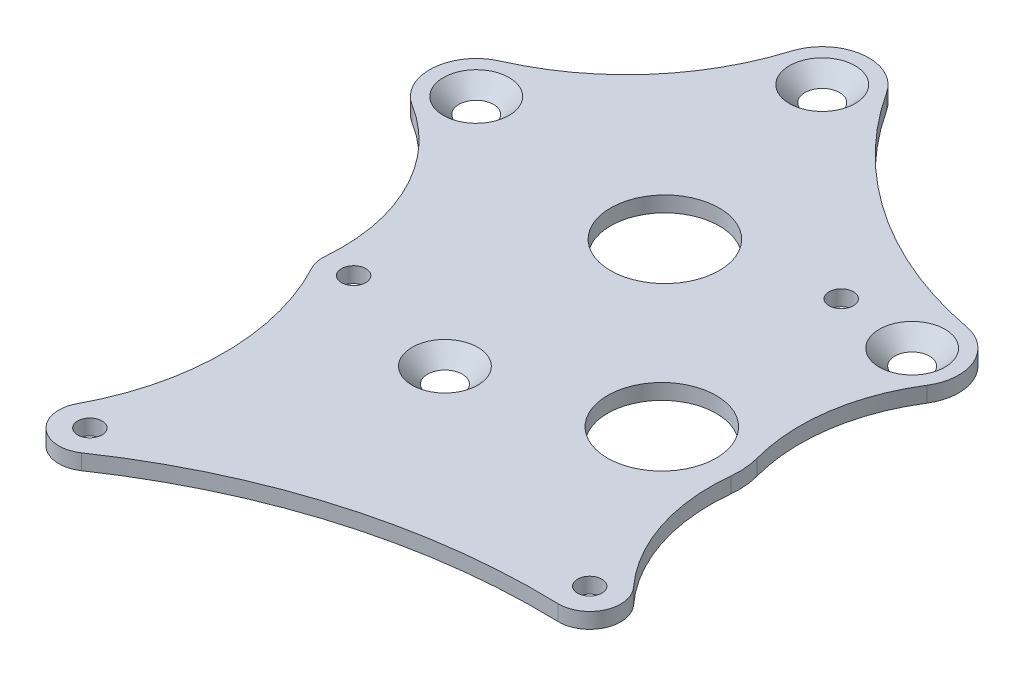
ISO-10303-21;
HEADER;
FILE_DESCRIPTION(('STEP AP214'),'2;1');
FILE_NAME('part.step','',(''),(''),'','','');
FILE_SCHEMA(('AUTOMOTIVE_DESIGN { 1 0 10303 214 1 1 1 1 }'));
ENDSEC;
DATA;
#1=APPLICATION_CONTEXT('core data for automotive mechanical design processes');
#2=APPLICATION_PROTOCOL_DEFINITION('international standard','automotive_design',2000,#1);
#3=PRODUCT_CONTEXT('',#1,'mechanical');
#4=PRODUCT('Part','Part','',(#3));
#5=PRODUCT_RELATED_PRODUCT_CATEGORY('part','',(#4));
#6=PRODUCT_DEFINITION_FORMATION('','',#4);
#7=PRODUCT_DEFINITION_CONTEXT('part definition',#1,'design');
#8=PRODUCT_DEFINITION('design','',#6,#7);
#9=PRODUCT_DEFINITION_SHAPE('','',#8);
#10=(LENGTH_UNIT() NAMED_UNIT(*) SI_UNIT(.MILLI.,.METRE.));
#11=(NAMED_UNIT(*) PLANE_ANGLE_UNIT() SI_UNIT($,.RADIAN.));
#12=(NAMED_UNIT(*) SI_UNIT($,.STERADIAN.) SOLID_ANGLE_UNIT());
#13=UNCERTAINTY_MEASURE_WITH_UNIT(LENGTH_MEASURE(1.E-05),#10,'distance_accuracy_value','');
#14=(GEOMETRIC_REPRESENTATION_CONTEXT(3) GLOBAL_UNCERTAINTY_ASSIGNED_CONTEXT((#13)) GLOBAL_UNIT_ASSIGNED_CONTEXT((#10,
#11,#12)) REPRESENTATION_CONTEXT('',''));
#15=CARTESIAN_POINT('',(0.,0.,0.));
#16=DIRECTION('',(0.,0.,1.));
#17=DIRECTION('',(1.,0.,0.));
#18=AXIS2_PLACEMENT_3D('',#15,#16,#17);
#19=CARTESIAN_POINT('',(40.1473132785361,11.4299999999996,-115.016732099234));
#20=DIRECTION('',(0.,1.,0.));
#21=DIRECTION('',(0.,0.,1.));
#22=AXIS2_PLACEMENT_3D('',#19,#20,#21);
#23=PLANE('',#22);
#24=CARTESIAN_POINT('',(-57.2999999999999,11.4299999999995,-136.359646841813));
#25=DIRECTION('',(0.,1.,0.));
#26=DIRECTION('',(0.,0.,1.));
#27=AXIS2_PLACEMENT_3D('',#24,#25,#26);
#28=CIRCLE('',#27,3.545);
#29=CARTESIAN_POINT('',(-57.2999999999999,11.4299999999995,-132.814646841813));
#30=VERTEX_POINT('',#29);
#31=EDGE_CURVE('E568',#30,#30,#28,.T.);
#32=ORIENTED_EDGE('',*,*,#31,.T.);
#33=EDGE_LOOP('',(#32));
#34=FACE_BOUND('',#33,.T.);
#35=CARTESIAN_POINT('',(-23.9999999999999,11.4299999999994,-173.859646841813));
#36=DIRECTION('',(0.,1.,0.));
#37=DIRECTION('',(0.,0.,1.));
#38=AXIS2_PLACEMENT_3D('',#35,#36,#37);
#39=CIRCLE('',#38,3.545);
#40=CARTESIAN_POINT('',(-23.9999999999999,11.4299999999994,-170.314646841813));
#41=VERTEX_POINT('',#40);
#42=EDGE_CURVE('E37',#41,#41,#39,.T.);
#43=ORIENTED_EDGE('',*,*,#42,.T.);
#44=EDGE_LOOP('',(#43));
#45=FACE_BOUND('',#44,.T.);
#46=CARTESIAN_POINT('',(31.9000000000001,11.4299999999995,-136.359646841813));
#47=DIRECTION('',(0.,1.,0.));
#48=DIRECTION('',(0.,0.,1.));
#49=AXIS2_PLACEMENT_3D('',#46,#47,#48);
#50=CIRCLE('',#49,3.54499999999999);
#51=CARTESIAN_POINT('',(31.9000000000001,11.4299999999995,-132.814646841813));
#52=VERTEX_POINT('',#51);
#53=EDGE_CURVE('E269',#52,#52,#50,.T.);
#54=ORIENTED_EDGE('',*,*,#53,.T.);
#55=EDGE_LOOP('',(#54));
#56=FACE_BOUND('',#55,.T.);
#57=CARTESIAN_POINT('',(-12.6999999999999,11.4299999999997,-85.3596468418129));
#58=DIRECTION('',(0.,1.,0.));
#59=DIRECTION('',(0.,0.,1.));
#60=AXIS2_PLACEMENT_3D('',#57,#58,#59);
#61=CIRCLE('',#60,3.545);
#62=CARTESIAN_POINT('',(-12.6999999999999,11.4299999999997,-81.8146468418129));
#63=VERTEX_POINT('',#62);
#64=EDGE_CURVE('E165',#63,#63,#61,.T.);
#65=ORIENTED_EDGE('',*,*,#64,.T.);
#66=EDGE_LOOP('',(#65));
#67=FACE_BOUND('',#66,.T.);
#68=CARTESIAN_POINT('',(-38.0999999999997,11.4299999999997,-92.0750000000001));
#69=DIRECTION('',(0.,1.,0.));
#70=DIRECTION('',(0.,0.,1.));
#71=AXIS2_PLACEMENT_3D('',#68,#69,#70);
#72=CIRCLE('',#71,6.35000000000001);
#73=CARTESIAN_POINT('',(-44.4267190902274,11.4299999999997,-92.6182545934906));
#74=VERTEX_POINT('',#73);
#75=CARTESIAN_POINT('',(-43.6973950552304,11.4299999999997,-89.076388888889));
#76=VERTEX_POINT('',#75);
#77=EDGE_CURVE('E225',#74,#76,#72,.T.);
#78=ORIENTED_EDGE('',*,*,#77,.F.);
#79=CARTESIAN_POINT('',(-82.3870336315935,11.4299999999997,-95.8777821544335));
#80=DIRECTION('',(0.,1.,0.));
#81=DIRECTION('',(0.,0.,1.));
#82=AXIS2_PLACEMENT_3D('',#79,#80,#81);
#83=CIRCLE('',#82,38.1);
#84=CARTESIAN_POINT('',(-62.3174067263185,11.4299999999996,-128.263273904337));
#85=VERTEX_POINT('',#84);
#86=EDGE_CURVE('E197',#74,#85,#83,.T.);
#87=ORIENTED_EDGE('',*,*,#86,.T.);
#88=CARTESIAN_POINT('',(-57.2999999999999,11.4299999999995,-136.359646841813));
#89=DIRECTION('',(0.,1.,0.));
#90=DIRECTION('',(0.,0.,1.));
#91=AXIS2_PLACEMENT_3D('',#88,#89,#90);
#92=CIRCLE('',#91,9.525);
#93=CARTESIAN_POINT('',(-61.1488031312675,11.4299999999995,-145.072415601326));
#94=VERTEX_POINT('',#93);
#95=EDGE_CURVE('E294',#85,#94,#92,.F.);
#96=ORIENTED_EDGE('',*,*,#95,.T.);
#97=CARTESIAN_POINT('',(-81.6757531646944,11.4299999999993,-191.540515652062));
#98=DIRECTION('',(0.,1.,0.));
#99=DIRECTION('',(0.,0.,1.));
#100=AXIS2_PLACEMENT_3D('',#97,#98,#99);
#101=CIRCLE('',#100,50.8);
#102=CARTESIAN_POINT('',(-33.1066978681096,11.4299999999994,-176.651362969747));
#103=VERTEX_POINT('',#102);
#104=EDGE_CURVE('E292',#94,#103,#101,.T.);
#105=ORIENTED_EDGE('',*,*,#104,.T.);
#106=CARTESIAN_POINT('',(-23.9999999999999,11.4299999999994,-173.859646841813));
#107=DIRECTION('',(0.,1.,0.));
#108=DIRECTION('',(0.,0.,1.));
#109=AXIS2_PLACEMENT_3D('',#106,#107,#108);
#110=CIRCLE('',#109,9.525);
#111=CARTESIAN_POINT('',(-16.0141646020796,11.4299999999994,-179.051183993498));
#112=VERTEX_POINT('',#111);
#113=EDGE_CURVE('E290',#103,#112,#110,.F.);
#114=ORIENTED_EDGE('',*,*,#113,.T.);
#115=CARTESIAN_POINT('',(47.872518581282,11.4299999999992,-220.583481206977));
#116=DIRECTION('',(0.,1.,0.));
#117=DIRECTION('',(0.,0.,1.));
#118=AXIS2_PLACEMENT_3D('',#115,#116,#117);
#119=CIRCLE('',#118,76.2);
#120=CARTESIAN_POINT('',(33.6747242868093,11.4299999999995,-145.717850660164));
#121=VERTEX_POINT('',#120);
#122=EDGE_CURVE('E288',#112,#121,#119,.T.);
#123=ORIENTED_EDGE('',*,*,#122,.T.);
#124=CARTESIAN_POINT('',(31.9000000000001,11.4299999999995,-136.359646841813));
#125=DIRECTION('',(0.,1.,0.));
#126=DIRECTION('',(0.,0.,1.));
#127=AXIS2_PLACEMENT_3D('',#124,#125,#126);
#128=CIRCLE('',#127,9.52499999999998);
#129=CARTESIAN_POINT('',(39.973858004257,11.4299999999995,-131.306089488117));
#130=VERTEX_POINT('',#129);
#131=EDGE_CURVE('E286',#121,#130,#128,.F.);
#132=ORIENTED_EDGE('',*,*,#131,.T.);
#133=CARTESIAN_POINT('',(72.269290021285,11.4299999999996,-111.091860073333));
#134=DIRECTION('',(0.,1.,0.));
#135=DIRECTION('',(0.,0.,1.));
#136=AXIS2_PLACEMENT_3D('',#133,#134,#135);
#137=CIRCLE('',#136,38.1);
#138=CARTESIAN_POINT('',(35.5247124459098,11.4299999999996,-101.019818631438));
#139=VERTEX_POINT('',#138);
#140=EDGE_CURVE('E142',#130,#139,#137,.T.);
#141=ORIENTED_EDGE('',*,*,#140,.T.);
#142=CARTESIAN_POINT('',(20.2144717895034,11.4299999999997,-96.823134697316));
#143=DIRECTION('',(0.,1.,0.));
#144=DIRECTION('',(0.,0.,1.));
#145=AXIS2_PLACEMENT_3D('',#142,#143,#144);
#146=CIRCLE('',#145,15.875);
#147=CARTESIAN_POINT('',(36.0026550587363,11.4299999999997,-95.1651557899969));
#148=VERTEX_POINT('',#147);
#149=EDGE_CURVE('E230',#148,#139,#146,.T.);
#150=ORIENTED_EDGE('',*,*,#149,.F.);
#151=CARTESIAN_POINT('',(73.8942949048952,11.4299999999997,-91.1860064124311));
#152=DIRECTION('',(0.,-1.,0.));
#153=DIRECTION('',(0.,0.,1.));
#154=AXIS2_PLACEMENT_3D('',#151,#152,#153);
#155=CIRCLE('',#154,38.1);
#156=CARTESIAN_POINT('',(45.7635261068066,11.4299999999998,-65.4902899050347));
#157=VERTEX_POINT('',#156);
#158=EDGE_CURVE('E251',#157,#148,#155,.T.);
#159=ORIENTED_EDGE('',*,*,#158,.F.);
#160=CARTESIAN_POINT('',(41.0750646404585,11.4299999999998,-61.2076704871353));
#161=DIRECTION('',(0.,1.,0.));
#162=DIRECTION('',(0.,0.,1.));
#163=AXIS2_PLACEMENT_3D('',#160,#161,#162);
#164=CIRCLE('',#163,6.35000000000001);
#165=CARTESIAN_POINT('',(40.8817934804246,11.4299999999998,-54.8606124080959));
#166=VERTEX_POINT('',#165);
#167=EDGE_CURVE('E249',#166,#157,#164,.T.);
#168=ORIENTED_EDGE('',*,*,#167,.F.);
#169=CARTESIAN_POINT('',(37.0163702797469,11.4300000000003,72.0805491726918));
#170=DIRECTION('',(0.,-1.,0.));
#171=DIRECTION('',(0.,0.,-1.));
#172=AXIS2_PLACEMENT_3D('',#169,#170,#171);
#173=CIRCLE('',#172,127.);
#174=CARTESIAN_POINT('',(-34.5230299866786,11.4299999999999,-32.8533071822529));
#175=VERTEX_POINT('',#174);
#176=EDGE_CURVE('E247',#175,#166,#173,.T.);
#177=ORIENTED_EDGE('',*,*,#176,.F.);
#178=CARTESIAN_POINT('',(-38.0999999999999,11.4299999999999,-38.1000000000001));
#179=DIRECTION('',(0.,1.,0.));
#180=DIRECTION('',(0.,0.,1.));
#181=AXIS2_PLACEMENT_3D('',#178,#179,#180);
#182=CIRCLE('',#181,6.35000000000001);
#183=CARTESIAN_POINT('',(-43.6973950552306,11.4299999999999,-41.0986111111112));
#184=VERTEX_POINT('',#183);
#185=EDGE_CURVE('E245',#184,#175,#182,.T.);
#186=ORIENTED_EDGE('',*,*,#185,.F.);
#187=CARTESIAN_POINT('',(-88.476555497076,11.4299999999998,-65.0875000000003));
#188=DIRECTION('',(0.,-1.,0.));
#189=DIRECTION('',(0.,0.,-1.));
#190=AXIS2_PLACEMENT_3D('',#187,#188,#189);
#191=CIRCLE('',#190,50.8);
#192=EDGE_CURVE('E243',#76,#184,#191,.T.);
#193=ORIENTED_EDGE('',*,*,#192,.F.);
#194=EDGE_LOOP('',(#78,#87,#96,#105,#114,#123,#132,#141,#150,#159,#168,#177,#186,#193));
#195=FACE_BOUND('',#194,.T.);
#196=CARTESIAN_POINT('',(-38.0999999999997,11.4299999999997,-92.0750000000001));
#197=DIRECTION('',(0.,1.,0.));
#198=DIRECTION('',(0.,0.,1.));
#199=AXIS2_PLACEMENT_3D('',#196,#197,#198);
#200=CIRCLE('',#199,2.4892);
#201=CARTESIAN_POINT('',(-38.0999999999997,11.4299999999997,-89.5858000000001));
#202=VERTEX_POINT('',#201);
#203=EDGE_CURVE('E219',#202,#202,#200,.T.);
#204=ORIENTED_EDGE('',*,*,#203,.T.);
#205=EDGE_LOOP('',(#204));
#206=FACE_BOUND('',#205,.T.);
#207=CARTESIAN_POINT('',(-38.0999999999999,11.4299999999999,-38.1000000000001));
#208=DIRECTION('',(0.,1.,0.));
#209=DIRECTION('',(0.,0.,1.));
#210=AXIS2_PLACEMENT_3D('',#207,#208,#209);
#211=CIRCLE('',#210,2.4892);
#212=CARTESIAN_POINT('',(-38.0999999999999,11.4299999999999,-35.6108000000001));
#213=VERTEX_POINT('',#212);
#214=EDGE_CURVE('E213',#213,#213,#211,.T.);
#215=ORIENTED_EDGE('',*,*,#214,.T.);
#216=EDGE_LOOP('',(#215));
#217=FACE_BOUND('',#216,.T.);
#218=CARTESIAN_POINT('',(15.8750000000005,11.4299999999995,-137.869384338277));
#219=DIRECTION('',(0.,1.,0.));
#220=DIRECTION('',(0.,0.,1.));
#221=AXIS2_PLACEMENT_3D('',#218,#219,#220);
#222=CIRCLE('',#221,2.4892);
#223=CARTESIAN_POINT('',(15.8750000000005,11.4299999999995,-135.380184338277));
#224=VERTEX_POINT('',#223);
#225=EDGE_CURVE('E207',#224,#224,#222,.T.);
#226=ORIENTED_EDGE('',*,*,#225,.T.);
#227=EDGE_LOOP('',(#226));
#228=FACE_BOUND('',#227,.T.);
#229=CARTESIAN_POINT('',(41.0750646404585,11.4299999999998,-61.2076704871353));
#230=DIRECTION('',(0.,1.,0.));
#231=DIRECTION('',(0.,0.,1.));
#232=AXIS2_PLACEMENT_3D('',#229,#230,#231);
#233=CIRCLE('',#232,2.4892);
#234=CARTESIAN_POINT('',(41.0750646404585,11.4299999999998,-58.7184704871353));
#235=VERTEX_POINT('',#234);
#236=EDGE_CURVE('E201',#235,#235,#233,.T.);
#237=ORIENTED_EDGE('',*,*,#236,.T.);
#238=EDGE_LOOP('',(#237));
#239=FACE_BOUND('',#238,.T.);
#240=CARTESIAN_POINT('',(20.2144717895034,11.4299999999997,-96.823134697316));
#241=DIRECTION('',(0.,1.,0.));
#242=DIRECTION('',(0.,0.,1.));
#243=AXIS2_PLACEMENT_3D('',#240,#241,#242);
#244=CIRCLE('',#243,11.1125);
#245=CARTESIAN_POINT('',(20.2144717895034,11.4299999999997,-85.710634697316));
#246=VERTEX_POINT('',#245);
#247=EDGE_CURVE('E193',#246,#246,#244,.T.);
#248=ORIENTED_EDGE('',*,*,#247,.T.);
#249=EDGE_LOOP('',(#248));
#250=FACE_BOUND('',#249,.T.);
#251=CARTESIAN_POINT('',(-12.6999999999999,11.4299999999995,-130.359646841813));
#252=DIRECTION('',(0.,1.,0.));
#253=DIRECTION('',(0.,0.,1.));
#254=AXIS2_PLACEMENT_3D('',#251,#252,#253);
#255=CIRCLE('',#254,11.1125);
#256=CARTESIAN_POINT('',(-12.6999999999999,11.4299999999996,-119.247146841813));
#257=VERTEX_POINT('',#256);
#258=EDGE_CURVE('E194',#257,#257,#255,.T.);
#259=ORIENTED_EDGE('',*,*,#258,.T.);
#260=EDGE_LOOP('',(#259));
#261=FACE_BOUND('',#260,.T.);
#262=ADVANCED_FACE('F33',(#34,#45,#56,#67,#195,#206,#217,#228,#239,#250,#261),#23,.F.);
#263=CARTESIAN_POINT('',(-38.0999999999997,14.6049999999997,-92.0750000000001));
#264=DIRECTION('',(0.,-1.,0.));
#265=DIRECTION('',(0.,0.,-1.));
#266=AXIS2_PLACEMENT_3D('',#263,#264,#265);
#267=CYLINDRICAL_SURFACE('',#266,6.35000000000001);
#268=DIRECTION('',(0.,1.,0.));
#269=VECTOR('',#268,1.);
#270=CARTESIAN_POINT('',(-44.4267190902274,-129.837832367374,-92.6182545934901));
#271=LINE('',#270,#269);
#272=CARTESIAN_POINT('',(-44.4267190902274,14.6049999999997,-92.6182545934906));
#273=VERTEX_POINT('',#272);
#274=EDGE_CURVE('E54',#74,#273,#271,.T.);
#275=ORIENTED_EDGE('',*,*,#274,.F.);
#276=ORIENTED_EDGE('',*,*,#77,.T.);
#277=DIRECTION('',(0.,-1.,0.));
#278=VECTOR('',#277,1.);
#279=CARTESIAN_POINT('',(-43.6973950552304,14.6049999999997,-89.076388888889));
#280=LINE('',#279,#278);
#281=CARTESIAN_POINT('',(-43.6973950552304,14.6049999999997,-89.076388888889));
#282=VERTEX_POINT('',#281);
#283=EDGE_CURVE('E11',#282,#76,#280,.T.);
#284=ORIENTED_EDGE('',*,*,#283,.F.);
#285=CARTESIAN_POINT('',(-38.0999999999997,14.6049999999997,-92.0750000000001));
#286=DIRECTION('',(0.,1.,0.));
#287=DIRECTION('',(0.,0.,1.));
#288=AXIS2_PLACEMENT_3D('',#285,#286,#287);
#289=CIRCLE('',#288,6.35000000000001);
#290=EDGE_CURVE('E50',#273,#282,#289,.T.);
#291=ORIENTED_EDGE('',*,*,#290,.F.);
#292=EDGE_LOOP('',(#275,#276,#284,#291));
#293=FACE_BOUND('',#292,.T.);
#294=ADVANCED_FACE('F35',(#293),#267,.T.);
#295=CARTESIAN_POINT('',(40.1473132785361,14.6049999999996,-115.016732099235));
#296=DIRECTION('',(0.,1.,0.));
#297=DIRECTION('',(0.,0.,1.));
#298=AXIS2_PLACEMENT_3D('',#295,#296,#297);
#299=PLANE('',#298);
#300=CARTESIAN_POINT('',(-57.2999999999999,14.6049999999995,-136.359646841813));
#301=DIRECTION('',(0.,1.,0.));
#302=DIRECTION('',(0.,0.,1.));
#303=AXIS2_PLACEMENT_3D('',#300,#301,#302);
#304=CIRCLE('',#303,6.72);
#305=CARTESIAN_POINT('',(-57.2999999999999,14.6049999999995,-129.639646841813));
#306=VERTEX_POINT('',#305);
#307=EDGE_CURVE('E566',#306,#306,#304,.T.);
#308=ORIENTED_EDGE('',*,*,#307,.F.);
#309=EDGE_LOOP('',(#308));
#310=FACE_BOUND('',#309,.T.);
#311=CARTESIAN_POINT('',(-23.9999999999999,14.6049999999994,-173.859646841813));
#312=DIRECTION('',(0.,1.,0.));
#313=DIRECTION('',(0.,0.,1.));
#314=AXIS2_PLACEMENT_3D('',#311,#312,#313);
#315=CIRCLE('',#314,6.72);
#316=CARTESIAN_POINT('',(-23.9999999999999,14.6049999999994,-167.139646841813));
#317=VERTEX_POINT('',#316);
#318=EDGE_CURVE('E281',#317,#317,#315,.T.);
#319=ORIENTED_EDGE('',*,*,#318,.F.);
#320=EDGE_LOOP('',(#319));
#321=FACE_BOUND('',#320,.T.);
#322=CARTESIAN_POINT('',(31.9000000000001,14.6049999999995,-136.359646841813));
#323=DIRECTION('',(0.,1.,0.));
#324=DIRECTION('',(0.,0.,1.));
#325=AXIS2_PLACEMENT_3D('',#322,#323,#324);
#326=CIRCLE('',#325,6.72);
#327=CARTESIAN_POINT('',(31.9000000000001,14.6049999999995,-129.639646841813));
#328=VERTEX_POINT('',#327);
#329=EDGE_CURVE('E271',#328,#328,#326,.T.);
#330=ORIENTED_EDGE('',*,*,#329,.F.);
#331=EDGE_LOOP('',(#330));
#332=FACE_BOUND('',#331,.T.);
#333=CARTESIAN_POINT('',(-12.6999999999999,14.6049999999997,-85.3596468418129));
#334=DIRECTION('',(0.,1.,0.));
#335=DIRECTION('',(0.,0.,1.));
#336=AXIS2_PLACEMENT_3D('',#333,#334,#335);
#337=CIRCLE('',#336,6.72);
#338=CARTESIAN_POINT('',(-12.6999999999999,14.6049999999997,-78.6396468418129));
#339=VERTEX_POINT('',#338);
#340=EDGE_CURVE('E268',#339,#339,#337,.T.);
#341=ORIENTED_EDGE('',*,*,#340,.F.);
#342=EDGE_LOOP('',(#341));
#343=FACE_BOUND('',#342,.T.);
#344=CARTESIAN_POINT('',(-82.3870336315935,14.6049999999997,-95.8777821544335));
#345=DIRECTION('',(0.,-1.,0.));
#346=DIRECTION('',(0.,0.,-1.));
#347=AXIS2_PLACEMENT_3D('',#344,#345,#346);
#348=CIRCLE('',#347,38.1);
#349=CARTESIAN_POINT('',(-62.3174067263186,14.6049999999996,-128.263273904337));
#350=VERTEX_POINT('',#349);
#351=EDGE_CURVE('E163',#350,#273,#348,.T.);
#352=ORIENTED_EDGE('',*,*,#351,.T.);
#353=ORIENTED_EDGE('',*,*,#290,.T.);
#354=CARTESIAN_POINT('',(-88.476555497076,14.6049999999998,-65.0875000000003));
#355=DIRECTION('',(0.,-1.,0.));
#356=DIRECTION('',(0.,0.,-1.));
#357=AXIS2_PLACEMENT_3D('',#354,#355,#356);
#358=CIRCLE('',#357,50.8);
#359=CARTESIAN_POINT('',(-43.6973950552306,14.6049999999999,-41.0986111111113));
#360=VERTEX_POINT('',#359);
#361=EDGE_CURVE('E229',#282,#360,#358,.T.);
#362=ORIENTED_EDGE('',*,*,#361,.T.);
#363=CARTESIAN_POINT('',(-38.0999999999999,14.6049999999999,-38.1000000000001));
#364=DIRECTION('',(0.,1.,0.));
#365=DIRECTION('',(0.,0.,1.));
#366=AXIS2_PLACEMENT_3D('',#363,#364,#365);
#367=CIRCLE('',#366,6.35000000000001);
#368=CARTESIAN_POINT('',(-34.5230299866786,14.6049999999999,-32.8533071822529));
#369=VERTEX_POINT('',#368);
#370=EDGE_CURVE('E232',#360,#369,#367,.T.);
#371=ORIENTED_EDGE('',*,*,#370,.T.);
#372=CARTESIAN_POINT('',(37.0163702797469,14.6050000000002,72.0805491726918));
#373=DIRECTION('',(0.,-1.,0.));
#374=DIRECTION('',(0.,0.,-1.));
#375=AXIS2_PLACEMENT_3D('',#372,#373,#374);
#376=CIRCLE('',#375,127.);
#377=CARTESIAN_POINT('',(40.8817934804246,14.6049999999998,-54.8606124080959));
#378=VERTEX_POINT('',#377);
#379=EDGE_CURVE('E234',#369,#378,#376,.T.);
#380=ORIENTED_EDGE('',*,*,#379,.T.);
#381=CARTESIAN_POINT('',(41.0750646404585,14.6049999999998,-61.2076704871353));
#382=DIRECTION('',(0.,1.,0.));
#383=DIRECTION('',(0.,0.,1.));
#384=AXIS2_PLACEMENT_3D('',#381,#382,#383);
#385=CIRCLE('',#384,6.35000000000001);
#386=CARTESIAN_POINT('',(45.7635261068066,14.6049999999998,-65.4902899050347));
#387=VERTEX_POINT('',#386);
#388=EDGE_CURVE('E236',#378,#387,#385,.T.);
#389=ORIENTED_EDGE('',*,*,#388,.T.);
#390=CARTESIAN_POINT('',(73.8942949048952,14.6049999999997,-91.1860064124312));
#391=DIRECTION('',(0.,-1.,0.));
#392=DIRECTION('',(0.,0.,1.));
#393=AXIS2_PLACEMENT_3D('',#390,#391,#392);
#394=CIRCLE('',#393,38.1);
#395=CARTESIAN_POINT('',(36.0026550587363,14.6049999999997,-95.1651557899969));
#396=VERTEX_POINT('',#395);
#397=EDGE_CURVE('E238',#387,#396,#394,.T.);
#398=ORIENTED_EDGE('',*,*,#397,.T.);
#399=CARTESIAN_POINT('',(20.2144717895034,14.6049999999997,-96.823134697316));
#400=DIRECTION('',(0.,1.,0.));
#401=DIRECTION('',(0.,0.,1.));
#402=AXIS2_PLACEMENT_3D('',#399,#400,#401);
#403=CIRCLE('',#402,15.875);
#404=CARTESIAN_POINT('',(35.5247124459098,14.6049999999996,-101.019818631439));
#405=VERTEX_POINT('',#404);
#406=EDGE_CURVE('E162',#396,#405,#403,.T.);
#407=ORIENTED_EDGE('',*,*,#406,.T.);
#408=CARTESIAN_POINT('',(72.269290021285,14.6049999999996,-111.091860073333));
#409=DIRECTION('',(0.,-1.,0.));
#410=DIRECTION('',(0.,0.,1.));
#411=AXIS2_PLACEMENT_3D('',#408,#409,#410);
#412=CIRCLE('',#411,38.1);
#413=CARTESIAN_POINT('',(39.9738580042571,14.6049999999995,-131.306089488117));
#414=VERTEX_POINT('',#413);
#415=EDGE_CURVE('E140',#405,#414,#412,.T.);
#416=ORIENTED_EDGE('',*,*,#415,.T.);
#417=CARTESIAN_POINT('',(31.9000000000001,14.6049999999995,-136.359646841813));
#418=DIRECTION('',(0.,1.,0.));
#419=DIRECTION('',(0.,0.,1.));
#420=AXIS2_PLACEMENT_3D('',#417,#418,#419);
#421=CIRCLE('',#420,9.52499999999998);
#422=CARTESIAN_POINT('',(33.6747242868092,14.6049999999995,-145.717850660165));
#423=VERTEX_POINT('',#422);
#424=EDGE_CURVE('E149',#414,#423,#421,.T.);
#425=ORIENTED_EDGE('',*,*,#424,.T.);
#426=CARTESIAN_POINT('',(47.872518581282,14.6049999999992,-220.583481206977));
#427=DIRECTION('',(0.,-1.,0.));
#428=DIRECTION('',(0.,0.,1.));
#429=AXIS2_PLACEMENT_3D('',#426,#427,#428);
#430=CIRCLE('',#429,76.2);
#431=CARTESIAN_POINT('',(-16.0141646020797,14.6049999999994,-179.051183993498));
#432=VERTEX_POINT('',#431);
#433=EDGE_CURVE('E155',#423,#432,#430,.T.);
#434=ORIENTED_EDGE('',*,*,#433,.T.);
#435=CARTESIAN_POINT('',(-23.9999999999999,14.6049999999994,-173.859646841813));
#436=DIRECTION('',(0.,1.,0.));
#437=DIRECTION('',(0.,0.,1.));
#438=AXIS2_PLACEMENT_3D('',#435,#436,#437);
#439=CIRCLE('',#438,9.525);
#440=CARTESIAN_POINT('',(-33.1066978681096,14.6049999999994,-176.651362969747));
#441=VERTEX_POINT('',#440);
#442=EDGE_CURVE('E170',#432,#441,#439,.T.);
#443=ORIENTED_EDGE('',*,*,#442,.T.);
#444=CARTESIAN_POINT('',(-81.6757531646944,14.6049999999993,-191.540515652062));
#445=DIRECTION('',(0.,-1.,0.));
#446=DIRECTION('',(0.,0.,1.));
#447=AXIS2_PLACEMENT_3D('',#444,#445,#446);
#448=CIRCLE('',#447,50.8);
#449=CARTESIAN_POINT('',(-61.1488031312674,14.6049999999995,-145.072415601326));
#450=VERTEX_POINT('',#449);
#451=EDGE_CURVE('E173',#441,#450,#448,.T.);
#452=ORIENTED_EDGE('',*,*,#451,.T.);
#453=CARTESIAN_POINT('',(-57.2999999999999,14.6049999999995,-136.359646841813));
#454=DIRECTION('',(0.,1.,0.));
#455=DIRECTION('',(0.,0.,1.));
#456=AXIS2_PLACEMENT_3D('',#453,#454,#455);
#457=CIRCLE('',#456,9.525);
#458=EDGE_CURVE('E176',#450,#350,#457,.T.);
#459=ORIENTED_EDGE('',*,*,#458,.T.);
#460=EDGE_LOOP('',(#352,#353,#362,#371,#380,#389,#398,#407,#416,#425,#434,#443,#452,#459));
#461=FACE_BOUND('',#460,.T.);
#462=CARTESIAN_POINT('',(20.2144717895034,14.6049999999997,-96.823134697316));
#463=DIRECTION('',(0.,1.,0.));
#464=DIRECTION('',(0.,0.,1.));
#465=AXIS2_PLACEMENT_3D('',#462,#463,#464);
#466=CIRCLE('',#465,11.1125);
#467=CARTESIAN_POINT('',(20.2144717895034,14.6049999999997,-85.710634697316));
#468=VERTEX_POINT('',#467);
#469=EDGE_CURVE('E198',#468,#468,#466,.T.);
#470=ORIENTED_EDGE('',*,*,#469,.F.);
#471=EDGE_LOOP('',(#470));
#472=FACE_BOUND('',#471,.T.);
#473=CARTESIAN_POINT('',(15.8750000000005,14.6049999999995,-137.869384338277));
#474=DIRECTION('',(0.,1.,0.));
#475=DIRECTION('',(0.,0.,1.));
#476=AXIS2_PLACEMENT_3D('',#473,#474,#475);
#477=CIRCLE('',#476,2.4892);
#478=CARTESIAN_POINT('',(15.8750000000005,14.6049999999995,-135.380184338277));
#479=VERTEX_POINT('',#478);
#480=EDGE_CURVE('E210',#479,#479,#477,.T.);
#481=ORIENTED_EDGE('',*,*,#480,.F.);
#482=EDGE_LOOP('',(#481));
#483=FACE_BOUND('',#482,.T.);
#484=CARTESIAN_POINT('',(-38.0999999999997,14.6049999999997,-92.0750000000001));
#485=DIRECTION('',(0.,1.,0.));
#486=DIRECTION('',(0.,0.,1.));
#487=AXIS2_PLACEMENT_3D('',#484,#485,#486);
#488=CIRCLE('',#487,2.4892);
#489=CARTESIAN_POINT('',(-38.0999999999997,14.6049999999997,-89.5858000000001));
#490=VERTEX_POINT('',#489);
#491=EDGE_CURVE('E222',#490,#490,#488,.T.);
#492=ORIENTED_EDGE('',*,*,#491,.F.);
#493=EDGE_LOOP('',(#492));
#494=FACE_BOUND('',#493,.T.);
#495=CARTESIAN_POINT('',(-38.0999999999999,14.6049999999999,-38.1000000000001));
#496=DIRECTION('',(0.,1.,0.));
#497=DIRECTION('',(0.,0.,1.));
#498=AXIS2_PLACEMENT_3D('',#495,#496,#497);
#499=CIRCLE('',#498,2.4892);
#500=CARTESIAN_POINT('',(-38.0999999999999,14.6049999999999,-35.6108000000001));
#501=VERTEX_POINT('',#500);
#502=EDGE_CURVE('E216',#501,#501,#499,.T.);
#503=ORIENTED_EDGE('',*,*,#502,.F.);
#504=EDGE_LOOP('',(#503));
#505=FACE_BOUND('',#504,.T.);
#506=CARTESIAN_POINT('',(41.0750646404585,14.6049999999998,-61.2076704871353));
#507=DIRECTION('',(0.,1.,0.));
#508=DIRECTION('',(0.,0.,1.));
#509=AXIS2_PLACEMENT_3D('',#506,#507,#508);
#510=CIRCLE('',#509,2.4892);
#511=CARTESIAN_POINT('',(41.0750646404585,14.6049999999998,-58.7184704871353));
#512=VERTEX_POINT('',#511);
#513=EDGE_CURVE('E204',#512,#512,#510,.T.);
#514=ORIENTED_EDGE('',*,*,#513,.F.);
#515=EDGE_LOOP('',(#514));
#516=FACE_BOUND('',#515,.T.);
#517=CARTESIAN_POINT('',(-12.6999999999999,14.6049999999995,-130.359646841813));
#518=DIRECTION('',(0.,1.,0.));
#519=DIRECTION('',(0.,0.,1.));
#520=AXIS2_PLACEMENT_3D('',#517,#518,#519);
#521=CIRCLE('',#520,11.1125);
#522=CARTESIAN_POINT('',(-12.6999999999999,14.6049999999996,-119.247146841813));
#523=VERTEX_POINT('',#522);
#524=EDGE_CURVE('E190',#523,#523,#521,.T.);
#525=ORIENTED_EDGE('',*,*,#524,.F.);
#526=EDGE_LOOP('',(#525));
#527=FACE_BOUND('',#526,.T.);
#528=ADVANCED_FACE('F159',(#310,#321,#332,#343,#461,#472,#483,#494,#505,#516,#527),#299,.T.);
#529=CARTESIAN_POINT('',(-88.476555497076,14.6049999999998,-65.0875000000003));
#530=DIRECTION('',(0.,-1.,0.));
#531=DIRECTION('',(0.,0.,-1.));
#532=AXIS2_PLACEMENT_3D('',#529,#530,#531);
#533=CYLINDRICAL_SURFACE('',#532,50.8);
#534=ORIENTED_EDGE('',*,*,#192,.T.);
#535=DIRECTION('',(0.,-1.,0.));
#536=VECTOR('',#535,1.);
#537=CARTESIAN_POINT('',(-43.6973950552306,14.6049999999999,-41.0986111111113));
#538=LINE('',#537,#536);
#539=EDGE_CURVE('E42',#360,#184,#538,.T.);
#540=ORIENTED_EDGE('',*,*,#539,.F.);
#541=ORIENTED_EDGE('',*,*,#361,.F.);
#542=ORIENTED_EDGE('',*,*,#283,.T.);
#543=EDGE_LOOP('',(#534,#540,#541,#542));
#544=FACE_BOUND('',#543,.T.);
#545=ADVANCED_FACE('F346',(#544),#533,.F.);
#546=CARTESIAN_POINT('',(-38.0999999999999,14.6049999999999,-38.1000000000001));
#547=DIRECTION('',(0.,-1.,0.));
#548=DIRECTION('',(0.,0.,-1.));
#549=AXIS2_PLACEMENT_3D('',#546,#547,#548);
#550=CYLINDRICAL_SURFACE('',#549,6.35000000000001);
#551=ORIENTED_EDGE('',*,*,#185,.T.);
#552=DIRECTION('',(0.,-1.,0.));
#553=VECTOR('',#552,1.);
#554=CARTESIAN_POINT('',(-34.5230299866786,14.6049999999999,-32.8533071822529));
#555=LINE('',#554,#553);
#556=EDGE_CURVE('E262',#369,#175,#555,.T.);
#557=ORIENTED_EDGE('',*,*,#556,.F.);
#558=ORIENTED_EDGE('',*,*,#370,.F.);
#559=ORIENTED_EDGE('',*,*,#539,.T.);
#560=EDGE_LOOP('',(#551,#557,#558,#559));
#561=FACE_BOUND('',#560,.T.);
#562=ADVANCED_FACE('F343',(#561),#550,.T.);
#563=CARTESIAN_POINT('',(37.0163702797469,14.6050000000002,72.0805491726918));
#564=DIRECTION('',(0.,-1.,0.));
#565=DIRECTION('',(0.,0.,-1.));
#566=AXIS2_PLACEMENT_3D('',#563,#564,#565);
#567=CYLINDRICAL_SURFACE('',#566,127.);
#568=ORIENTED_EDGE('',*,*,#176,.T.);
#569=DIRECTION('',(0.,-1.,0.));
#570=VECTOR('',#569,1.);
#571=CARTESIAN_POINT('',(40.8817934804246,14.6049999999998,-54.8606124080959));
#572=LINE('',#571,#570);
#573=EDGE_CURVE('E259',#378,#166,#572,.T.);
#574=ORIENTED_EDGE('',*,*,#573,.F.);
#575=ORIENTED_EDGE('',*,*,#379,.F.);
#576=ORIENTED_EDGE('',*,*,#556,.T.);
#577=EDGE_LOOP('',(#568,#574,#575,#576));
#578=FACE_BOUND('',#577,.T.);
#579=ADVANCED_FACE('F339',(#578),#567,.F.);
#580=CARTESIAN_POINT('',(41.0750646404585,14.6049999999998,-61.2076704871353));
#581=DIRECTION('',(0.,-1.,0.));
#582=DIRECTION('',(0.,0.,-1.));
#583=AXIS2_PLACEMENT_3D('',#580,#581,#582);
#584=CYLINDRICAL_SURFACE('',#583,6.35000000000001);
#585=ORIENTED_EDGE('',*,*,#167,.T.);
#586=DIRECTION('',(0.,-1.,0.));
#587=VECTOR('',#586,1.);
#588=CARTESIAN_POINT('',(45.7635261068066,14.6049999999998,-65.4902899050347));
#589=LINE('',#588,#587);
#590=EDGE_CURVE('E256',#387,#157,#589,.T.);
#591=ORIENTED_EDGE('',*,*,#590,.F.);
#592=ORIENTED_EDGE('',*,*,#388,.F.);
#593=ORIENTED_EDGE('',*,*,#573,.T.);
#594=EDGE_LOOP('',(#585,#591,#592,#593));
#595=FACE_BOUND('',#594,.T.);
#596=ADVANCED_FACE('F334',(#595),#584,.T.);
#597=CARTESIAN_POINT('',(73.8942949048952,14.6049999999997,-91.1860064124312));
#598=DIRECTION('',(0.,-1.,0.));
#599=DIRECTION('',(0.,0.,-1.));
#600=AXIS2_PLACEMENT_3D('',#597,#598,#599);
#601=CYLINDRICAL_SURFACE('',#600,38.1);
#602=ORIENTED_EDGE('',*,*,#158,.T.);
#603=DIRECTION('',(0.,-1.,0.));
#604=VECTOR('',#603,1.);
#605=CARTESIAN_POINT('',(36.0026550587363,14.6049999999997,-95.1651557899969));
#606=LINE('',#605,#604);
#607=EDGE_CURVE('E241',#396,#148,#606,.T.);
#608=ORIENTED_EDGE('',*,*,#607,.F.);
#609=ORIENTED_EDGE('',*,*,#397,.F.);
#610=ORIENTED_EDGE('',*,*,#590,.T.);
#611=EDGE_LOOP('',(#602,#608,#609,#610));
#612=FACE_BOUND('',#611,.T.);
#613=ADVANCED_FACE('F328',(#612),#601,.F.);
#614=CARTESIAN_POINT('',(20.2144717895034,14.6049999999997,-96.823134697316));
#615=DIRECTION('',(0.,-1.,0.));
#616=DIRECTION('',(0.,0.,-1.));
#617=AXIS2_PLACEMENT_3D('',#614,#615,#616);
#618=CYLINDRICAL_SURFACE('',#617,15.875);
#619=ORIENTED_EDGE('',*,*,#149,.T.);
#620=DIRECTION('',(0.,1.,0.));
#621=VECTOR('',#620,1.);
#622=CARTESIAN_POINT('',(35.5247124459098,-129.837832367374,-101.019818631438));
#623=LINE('',#622,#621);
#624=EDGE_CURVE('E146',#139,#405,#623,.T.);
#625=ORIENTED_EDGE('',*,*,#624,.T.);
#626=ORIENTED_EDGE('',*,*,#406,.F.);
#627=ORIENTED_EDGE('',*,*,#607,.T.);
#628=EDGE_LOOP('',(#619,#625,#626,#627));
#629=FACE_BOUND('',#628,.T.);
#630=ADVANCED_FACE('F324',(#629),#618,.T.);
#631=CARTESIAN_POINT('',(-38.0999999999997,14.6049999999997,-92.0750000000001));
#632=DIRECTION('',(0.,-1.,0.));
#633=DIRECTION('',(0.,0.,-1.));
#634=AXIS2_PLACEMENT_3D('',#631,#632,#633);
#635=CYLINDRICAL_SURFACE('',#634,2.4892);
#636=ORIENTED_EDGE('',*,*,#491,.T.);
#637=EDGE_LOOP('',(#636));
#638=FACE_BOUND('',#637,.T.);
#639=ORIENTED_EDGE('',*,*,#203,.F.);
#640=EDGE_LOOP('',(#639));
#641=FACE_BOUND('',#640,.T.);
#642=ADVANCED_FACE('F367',(#638,#641),#635,.F.);
#643=CARTESIAN_POINT('',(-38.0999999999999,14.6049999999999,-38.1000000000001));
#644=DIRECTION('',(0.,-1.,0.));
#645=DIRECTION('',(0.,0.,-1.));
#646=AXIS2_PLACEMENT_3D('',#643,#644,#645);
#647=CYLINDRICAL_SURFACE('',#646,2.4892);
#648=ORIENTED_EDGE('',*,*,#502,.T.);
#649=EDGE_LOOP('',(#648));
#650=FACE_BOUND('',#649,.T.);
#651=ORIENTED_EDGE('',*,*,#214,.F.);
#652=EDGE_LOOP('',(#651));
#653=FACE_BOUND('',#652,.T.);
#654=ADVANCED_FACE('F408',(#650,#653),#647,.F.);
#655=CARTESIAN_POINT('',(15.8750000000005,14.6049999999995,-137.869384338277));
#656=DIRECTION('',(0.,-1.,0.));
#657=DIRECTION('',(0.,0.,-1.));
#658=AXIS2_PLACEMENT_3D('',#655,#656,#657);
#659=CYLINDRICAL_SURFACE('',#658,2.4892);
#660=ORIENTED_EDGE('',*,*,#480,.T.);
#661=EDGE_LOOP('',(#660));
#662=FACE_BOUND('',#661,.T.);
#663=ORIENTED_EDGE('',*,*,#225,.F.);
#664=EDGE_LOOP('',(#663));
#665=FACE_BOUND('',#664,.T.);
#666=ADVANCED_FACE('F414',(#662,#665),#659,.F.);
#667=CARTESIAN_POINT('',(41.0750646404585,14.6049999999998,-61.2076704871353));
#668=DIRECTION('',(0.,-1.,0.));
#669=DIRECTION('',(0.,0.,-1.));
#670=AXIS2_PLACEMENT_3D('',#667,#668,#669);
#671=CYLINDRICAL_SURFACE('',#670,2.4892);
#672=ORIENTED_EDGE('',*,*,#513,.T.);
#673=EDGE_LOOP('',(#672));
#674=FACE_BOUND('',#673,.T.);
#675=ORIENTED_EDGE('',*,*,#236,.F.);
#676=EDGE_LOOP('',(#675));
#677=FACE_BOUND('',#676,.T.);
#678=ADVANCED_FACE('F422',(#674,#677),#671,.F.);
#679=CARTESIAN_POINT('',(20.2144717895034,14.6049999999997,-96.823134697316));
#680=DIRECTION('',(0.,-1.,0.));
#681=DIRECTION('',(0.,0.,-1.));
#682=AXIS2_PLACEMENT_3D('',#679,#680,#681);
#683=CYLINDRICAL_SURFACE('',#682,11.1125);
#684=ORIENTED_EDGE('',*,*,#469,.T.);
#685=EDGE_LOOP('',(#684));
#686=FACE_BOUND('',#685,.T.);
#687=ORIENTED_EDGE('',*,*,#247,.F.);
#688=EDGE_LOOP('',(#687));
#689=FACE_BOUND('',#688,.T.);
#690=ADVANCED_FACE('F430',(#686,#689),#683,.F.);
#691=CARTESIAN_POINT('',(-12.6999999999999,14.6049999999995,-130.359646841813));
#692=DIRECTION('',(0.,-1.,0.));
#693=DIRECTION('',(0.,0.,-1.));
#694=AXIS2_PLACEMENT_3D('',#691,#692,#693);
#695=CYLINDRICAL_SURFACE('',#694,11.1125);
#696=ORIENTED_EDGE('',*,*,#524,.T.);
#697=EDGE_LOOP('',(#696));
#698=FACE_BOUND('',#697,.T.);
#699=ORIENTED_EDGE('',*,*,#258,.F.);
#700=EDGE_LOOP('',(#699));
#701=FACE_BOUND('',#700,.T.);
#702=ADVANCED_FACE('F438',(#698,#701),#695,.F.);
#703=CARTESIAN_POINT('',(-82.3870336315935,-129.837832367374,-95.877782154433));
#704=DIRECTION('',(0.,1.,0.));
#705=DIRECTION('',(0.,0.,1.));
#706=AXIS2_PLACEMENT_3D('',#703,#704,#705);
#707=CYLINDRICAL_SURFACE('',#706,38.1);
#708=ORIENTED_EDGE('',*,*,#86,.F.);
#709=ORIENTED_EDGE('',*,*,#274,.T.);
#710=ORIENTED_EDGE('',*,*,#351,.F.);
#711=DIRECTION('',(0.,1.,0.));
#712=VECTOR('',#711,1.);
#713=CARTESIAN_POINT('',(-62.3174067263186,-129.837832367374,-128.263273904337));
#714=LINE('',#713,#712);
#715=EDGE_CURVE('E179',#85,#350,#714,.T.);
#716=ORIENTED_EDGE('',*,*,#715,.F.);
#717=EDGE_LOOP('',(#708,#709,#710,#716));
#718=FACE_BOUND('',#717,.T.);
#719=ADVANCED_FACE('F308',(#718),#707,.F.);
#720=CARTESIAN_POINT('',(-57.2999999999999,-129.837832367374,-136.359646841812));
#721=DIRECTION('',(0.,1.,0.));
#722=DIRECTION('',(0.,0.,1.));
#723=AXIS2_PLACEMENT_3D('',#720,#721,#722);
#724=CYLINDRICAL_SURFACE('',#723,9.525);
#725=ORIENTED_EDGE('',*,*,#95,.F.);
#726=ORIENTED_EDGE('',*,*,#715,.T.);
#727=ORIENTED_EDGE('',*,*,#458,.F.);
#728=DIRECTION('',(0.,1.,0.));
#729=VECTOR('',#728,1.);
#730=CARTESIAN_POINT('',(-61.1488031312674,-129.837832367374,-145.072415601325));
#731=LINE('',#730,#729);
#732=EDGE_CURVE('E181',#94,#450,#731,.T.);
#733=ORIENTED_EDGE('',*,*,#732,.F.);
#734=EDGE_LOOP('',(#725,#726,#727,#733));
#735=FACE_BOUND('',#734,.T.);
#736=ADVANCED_FACE('F305',(#735),#724,.T.);
#737=CARTESIAN_POINT('',(-81.6757531646944,-129.837832367374,-191.540515652061));
#738=DIRECTION('',(0.,1.,0.));
#739=DIRECTION('',(0.,0.,1.));
#740=AXIS2_PLACEMENT_3D('',#737,#738,#739);
#741=CYLINDRICAL_SURFACE('',#740,50.8);
#742=ORIENTED_EDGE('',*,*,#104,.F.);
#743=ORIENTED_EDGE('',*,*,#732,.T.);
#744=ORIENTED_EDGE('',*,*,#451,.F.);
#745=DIRECTION('',(0.,1.,0.));
#746=VECTOR('',#745,1.);
#747=CARTESIAN_POINT('',(-33.1066978681096,-129.837832367374,-176.651362969746));
#748=LINE('',#747,#746);
#749=EDGE_CURVE('E183',#103,#441,#748,.T.);
#750=ORIENTED_EDGE('',*,*,#749,.F.);
#751=EDGE_LOOP('',(#742,#743,#744,#750));
#752=FACE_BOUND('',#751,.T.);
#753=ADVANCED_FACE('F313',(#752),#741,.F.);
#754=CARTESIAN_POINT('',(-23.9999999999999,-129.837832367374,-173.859646841812));
#755=DIRECTION('',(0.,1.,0.));
#756=DIRECTION('',(0.,0.,1.));
#757=AXIS2_PLACEMENT_3D('',#754,#755,#756);
#758=CYLINDRICAL_SURFACE('',#757,9.525);
#759=ORIENTED_EDGE('',*,*,#113,.F.);
#760=ORIENTED_EDGE('',*,*,#749,.T.);
#761=ORIENTED_EDGE('',*,*,#442,.F.);
#762=DIRECTION('',(0.,1.,0.));
#763=VECTOR('',#762,1.);
#764=CARTESIAN_POINT('',(-16.0141646020797,-129.837832367374,-179.051183993497));
#765=LINE('',#764,#763);
#766=EDGE_CURVE('E185',#112,#432,#765,.T.);
#767=ORIENTED_EDGE('',*,*,#766,.F.);
#768=EDGE_LOOP('',(#759,#760,#761,#767));
#769=FACE_BOUND('',#768,.T.);
#770=ADVANCED_FACE('F318',(#769),#758,.T.);
#771=CARTESIAN_POINT('',(47.872518581282,-129.837832367374,-220.583481206977));
#772=DIRECTION('',(0.,1.,0.));
#773=DIRECTION('',(0.,0.,1.));
#774=AXIS2_PLACEMENT_3D('',#771,#772,#773);
#775=CYLINDRICAL_SURFACE('',#774,76.2);
#776=ORIENTED_EDGE('',*,*,#122,.F.);
#777=ORIENTED_EDGE('',*,*,#766,.T.);
#778=ORIENTED_EDGE('',*,*,#433,.F.);
#779=DIRECTION('',(0.,1.,0.));
#780=VECTOR('',#779,1.);
#781=CARTESIAN_POINT('',(33.6747242868092,-129.837832367374,-145.717850660164));
#782=LINE('',#781,#780);
#783=EDGE_CURVE('E145',#121,#423,#782,.T.);
#784=ORIENTED_EDGE('',*,*,#783,.F.);
#785=EDGE_LOOP('',(#776,#777,#778,#784));
#786=FACE_BOUND('',#785,.T.);
#787=ADVANCED_FACE('F320',(#786),#775,.F.);
#788=CARTESIAN_POINT('',(31.9000000000001,-129.837832367374,-136.359646841812));
#789=DIRECTION('',(0.,1.,0.));
#790=DIRECTION('',(0.,0.,1.));
#791=AXIS2_PLACEMENT_3D('',#788,#789,#790);
#792=CYLINDRICAL_SURFACE('',#791,9.52499999999998);
#793=ORIENTED_EDGE('',*,*,#131,.F.);
#794=ORIENTED_EDGE('',*,*,#783,.T.);
#795=ORIENTED_EDGE('',*,*,#424,.F.);
#796=DIRECTION('',(0.,1.,0.));
#797=VECTOR('',#796,1.);
#798=CARTESIAN_POINT('',(39.9738580042571,-129.837832367374,-131.306089488116));
#799=LINE('',#798,#797);
#800=EDGE_CURVE('E135',#130,#414,#799,.T.);
#801=ORIENTED_EDGE('',*,*,#800,.F.);
#802=EDGE_LOOP('',(#793,#794,#795,#801));
#803=FACE_BOUND('',#802,.T.);
#804=ADVANCED_FACE('F150',(#803),#792,.T.);
#805=CARTESIAN_POINT('',(72.269290021285,-129.837832367374,-111.091860073332));
#806=DIRECTION('',(0.,1.,0.));
#807=DIRECTION('',(0.,0.,1.));
#808=AXIS2_PLACEMENT_3D('',#805,#806,#807);
#809=CYLINDRICAL_SURFACE('',#808,38.1);
#810=ORIENTED_EDGE('',*,*,#140,.F.);
#811=ORIENTED_EDGE('',*,*,#800,.T.);
#812=ORIENTED_EDGE('',*,*,#415,.F.);
#813=ORIENTED_EDGE('',*,*,#624,.F.);
#814=EDGE_LOOP('',(#810,#811,#812,#813));
#815=FACE_BOUND('',#814,.T.);
#816=ADVANCED_FACE('F137',(#815),#809,.F.);
#817=CARTESIAN_POINT('',(-12.6999999999999,14.6049999999997,-85.3596468418129));
#818=DIRECTION('',(0.,1.,0.));
#819=DIRECTION('',(0.,0.,1.));
#820=AXIS2_PLACEMENT_3D('',#817,#818,#819);
#821=CONICAL_SURFACE('',#820,6.72,0.785398163397449);
#822=ORIENTED_EDGE('',*,*,#340,.T.);
#823=EDGE_LOOP('',(#822));
#824=FACE_BOUND('',#823,.T.);
#825=ORIENTED_EDGE('',*,*,#64,.F.);
#826=EDGE_LOOP('',(#825));
#827=FACE_BOUND('',#826,.T.);
#828=ADVANCED_FACE('F509',(#824,#827),#821,.F.);
#829=CARTESIAN_POINT('',(31.9000000000001,14.6049999999995,-136.359646841813));
#830=DIRECTION('',(0.,1.,0.));
#831=DIRECTION('',(0.,0.,1.));
#832=AXIS2_PLACEMENT_3D('',#829,#830,#831);
#833=CONICAL_SURFACE('',#832,6.72,0.78539816339745);
#834=ORIENTED_EDGE('',*,*,#329,.T.);
#835=EDGE_LOOP('',(#834));
#836=FACE_BOUND('',#835,.T.);
#837=ORIENTED_EDGE('',*,*,#53,.F.);
#838=EDGE_LOOP('',(#837));
#839=FACE_BOUND('',#838,.T.);
#840=ADVANCED_FACE('F523',(#836,#839),#833,.F.);
#841=CARTESIAN_POINT('',(-23.9999999999999,14.6049999999994,-173.859646841813));
#842=DIRECTION('',(0.,1.,0.));
#843=DIRECTION('',(0.,0.,1.));
#844=AXIS2_PLACEMENT_3D('',#841,#842,#843);
#845=CONICAL_SURFACE('',#844,6.72,0.785398163397449);
#846=ORIENTED_EDGE('',*,*,#318,.T.);
#847=EDGE_LOOP('',(#846));
#848=FACE_BOUND('',#847,.T.);
#849=ORIENTED_EDGE('',*,*,#42,.F.);
#850=EDGE_LOOP('',(#849));
#851=FACE_BOUND('',#850,.T.);
#852=ADVANCED_FACE('F532',(#848,#851),#845,.F.);
#853=CARTESIAN_POINT('',(-57.2999999999999,14.6049999999995,-136.359646841813));
#854=DIRECTION('',(0.,1.,0.));
#855=DIRECTION('',(0.,0.,1.));
#856=AXIS2_PLACEMENT_3D('',#853,#854,#855);
#857=CONICAL_SURFACE('',#856,6.72,0.785398163397449);
#858=ORIENTED_EDGE('',*,*,#307,.T.);
#859=EDGE_LOOP('',(#858));
#860=FACE_BOUND('',#859,.T.);
#861=ORIENTED_EDGE('',*,*,#31,.F.);
#862=EDGE_LOOP('',(#861));
#863=FACE_BOUND('',#862,.T.);
#864=ADVANCED_FACE('F540',(#860,#863),#857,.F.);
#865=CLOSED_SHELL('',(#262,#294,#528,#545,#562,#579,#596,#613,#630,#642,#654,#666,#678,#690,
#702,#719,#736,#753,#770,#787,#804,#816,#828,#840,#852,#864));
#866=MANIFOLD_SOLID_BREP('B2',#865);
#867=ADVANCED_BREP_SHAPE_REPRESENTATION('',(#18,#866),#14);
#868=SHAPE_DEFINITION_REPRESENTATION(#9,#867);
ENDSEC;
END-ISO-10303-21;
